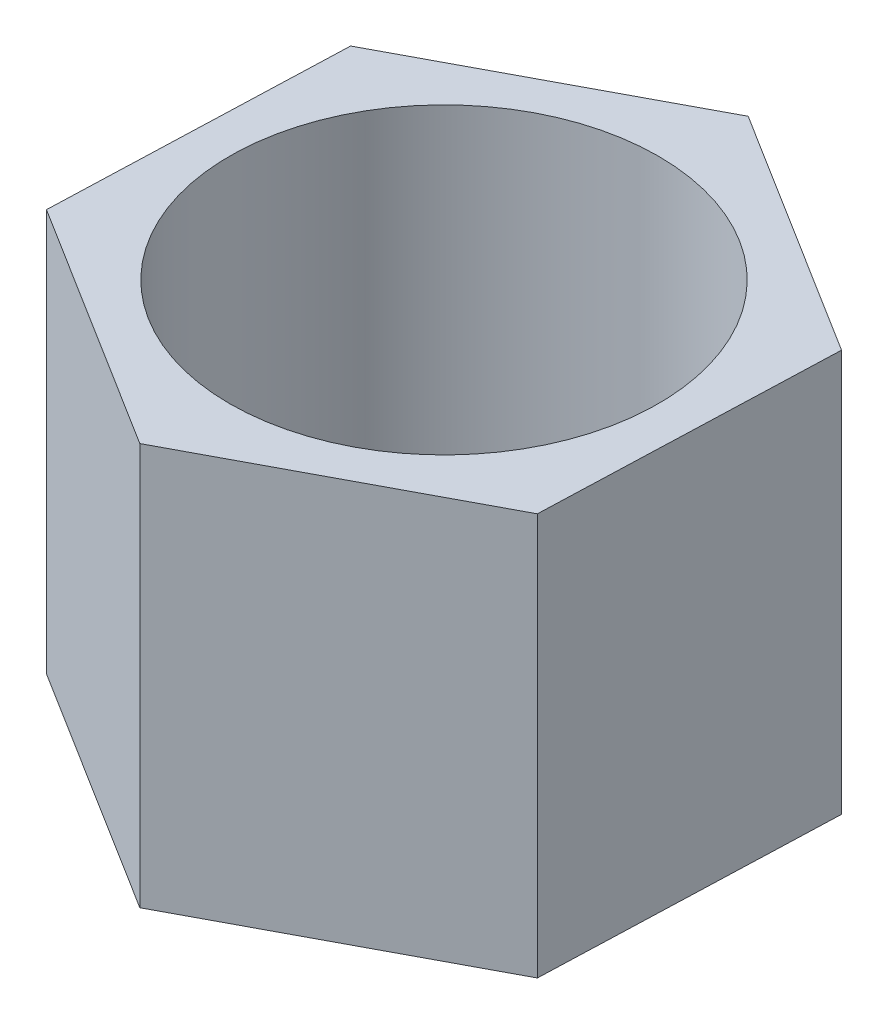
ISO-10303-21;
HEADER;
FILE_DESCRIPTION(('STEP AP214'),'2;1');
FILE_NAME('part.step','',(''),(''),'','','');
FILE_SCHEMA(('AUTOMOTIVE_DESIGN { 1 0 10303 214 1 1 1 1 }'));
ENDSEC;
DATA;
#1=APPLICATION_CONTEXT('core data for automotive mechanical design processes');
#2=APPLICATION_PROTOCOL_DEFINITION('international standard','automotive_design',2000,#1);
#3=PRODUCT_CONTEXT('',#1,'mechanical');
#4=PRODUCT('Part','Part','',(#3));
#5=PRODUCT_RELATED_PRODUCT_CATEGORY('part','',(#4));
#6=PRODUCT_DEFINITION_FORMATION('','',#4);
#7=PRODUCT_DEFINITION_CONTEXT('part definition',#1,'design');
#8=PRODUCT_DEFINITION('design','',#6,#7);
#9=PRODUCT_DEFINITION_SHAPE('','',#8);
#10=(LENGTH_UNIT() NAMED_UNIT(*) SI_UNIT(.MILLI.,.METRE.));
#11=(NAMED_UNIT(*) PLANE_ANGLE_UNIT() SI_UNIT($,.RADIAN.));
#12=(NAMED_UNIT(*) SI_UNIT($,.STERADIAN.) SOLID_ANGLE_UNIT());
#13=UNCERTAINTY_MEASURE_WITH_UNIT(LENGTH_MEASURE(1.E-05),#10,'distance_accuracy_value','');
#14=(GEOMETRIC_REPRESENTATION_CONTEXT(3) GLOBAL_UNCERTAINTY_ASSIGNED_CONTEXT((#13)) GLOBAL_UNIT_ASSIGNED_CONTEXT((#10,
#11,#12)) REPRESENTATION_CONTEXT('',''));
#15=CARTESIAN_POINT('',(0.,0.,0.));
#16=DIRECTION('',(0.,0.,1.));
#17=DIRECTION('',(1.,0.,0.));
#18=AXIS2_PLACEMENT_3D('',#15,#16,#17);
#19=CARTESIAN_POINT('',(0.,15.,0.));
#20=DIRECTION('',(0.,1.,0.));
#21=DIRECTION('',(0.,0.,1.));
#22=AXIS2_PLACEMENT_3D('',#19,#20,#21);
#23=PLANE('',#22);
#24=DIRECTION('',(-0.883119740596847,0.,0.469147656679811));
#25=VECTOR('',#24,1.);
#26=CARTESIAN_POINT('',(0.386856751164281,15.,-10.9628315314709));
#27=LINE('',#26,#25);
#28=CARTESIAN_POINT('',(0.386856751164281,15.,-10.9628315314709));
#29=VERTEX_POINT('',#28);
#30=CARTESIAN_POINT('',(-9.3006622280807,15.,-5.81644353986922));
#31=VERTEX_POINT('',#30);
#32=EDGE_CURVE('E131',#29,#31,#27,.T.);
#33=ORIENTED_EDGE('',*,*,#32,.T.);
#34=DIRECTION('',(-0.0352660814877668,0.,0.999377958280299));
#35=VECTOR('',#34,1.);
#36=CARTESIAN_POINT('',(-9.3006622280807,15.,-5.81644353986922));
#37=LINE('',#36,#35);
#38=CARTESIAN_POINT('',(-9.68751897924498,15.,5.14638799160165));
#39=VERTEX_POINT('',#38);
#40=EDGE_CURVE('E89',#31,#39,#37,.T.);
#41=ORIENTED_EDGE('',*,*,#40,.T.);
#42=DIRECTION('',(0.84785365910908,0.,0.530230301600487));
#43=VECTOR('',#42,1.);
#44=CARTESIAN_POINT('',(-9.68751897924498,15.,5.14638799160165));
#45=LINE('',#44,#43);
#46=CARTESIAN_POINT('',(-0.386856751164283,15.,10.9628315314709));
#47=VERTEX_POINT('',#46);
#48=EDGE_CURVE('E102',#39,#47,#45,.T.);
#49=ORIENTED_EDGE('',*,*,#48,.T.);
#50=DIRECTION('',(0.883119740596847,0.,-0.469147656679811));
#51=VECTOR('',#50,1.);
#52=CARTESIAN_POINT('',(-0.386856751164283,15.,10.9628315314709));
#53=LINE('',#52,#51);
#54=CARTESIAN_POINT('',(9.30066222808069,15.,5.81644353986922));
#55=VERTEX_POINT('',#54);
#56=EDGE_CURVE('E96',#47,#55,#53,.T.);
#57=ORIENTED_EDGE('',*,*,#56,.T.);
#58=DIRECTION('',(0.0352660814877666,0.,-0.999377958280299));
#59=VECTOR('',#58,1.);
#60=CARTESIAN_POINT('',(9.30066222808069,15.,5.81644353986922));
#61=LINE('',#60,#59);
#62=CARTESIAN_POINT('',(9.68751897924498,15.,-5.14638799160165));
#63=VERTEX_POINT('',#62);
#64=EDGE_CURVE('E100',#55,#63,#61,.T.);
#65=ORIENTED_EDGE('',*,*,#64,.T.);
#66=DIRECTION('',(-0.84785365910908,0.,-0.530230301600487));
#67=VECTOR('',#66,1.);
#68=CARTESIAN_POINT('',(9.68751897924498,15.,-5.14638799160165));
#69=LINE('',#68,#67);
#70=EDGE_CURVE('E52',#63,#29,#69,.T.);
#71=ORIENTED_EDGE('',*,*,#70,.T.);
#72=EDGE_LOOP('',(#33,#41,#49,#57,#65,#71));
#73=FACE_BOUND('',#72,.T.);
#74=CARTESIAN_POINT('',(0.,15.,0.));
#75=DIRECTION('',(0.,1.,0.));
#76=DIRECTION('',(0.,0.,1.));
#77=AXIS2_PLACEMENT_3D('',#74,#75,#76);
#78=CIRCLE('',#77,8.);
#79=CARTESIAN_POINT('',(0.,15.,8.));
#80=VERTEX_POINT('',#79);
#81=EDGE_CURVE('E124',#80,#80,#78,.T.);
#82=ORIENTED_EDGE('',*,*,#81,.F.);
#83=EDGE_LOOP('',(#82));
#84=FACE_BOUND('',#83,.T.);
#85=ADVANCED_FACE('F35',(#73,#84),#23,.T.);
#86=CARTESIAN_POINT('',(0.,0.,0.));
#87=DIRECTION('',(0.,1.,0.));
#88=DIRECTION('',(0.,0.,1.));
#89=AXIS2_PLACEMENT_3D('',#86,#87,#88);
#90=PLANE('',#89);
#91=DIRECTION('',(-0.883119740596847,0.,0.469147656679811));
#92=VECTOR('',#91,1.);
#93=CARTESIAN_POINT('',(0.386856751164281,0.,-10.9628315314709));
#94=LINE('',#93,#92);
#95=CARTESIAN_POINT('',(0.386856751164281,0.,-10.9628315314709));
#96=VERTEX_POINT('',#95);
#97=CARTESIAN_POINT('',(-9.3006622280807,0.,-5.81644353986922));
#98=VERTEX_POINT('',#97);
#99=EDGE_CURVE('E120',#96,#98,#94,.T.);
#100=ORIENTED_EDGE('',*,*,#99,.F.);
#101=DIRECTION('',(-0.84785365910908,0.,-0.530230301600487));
#102=VECTOR('',#101,1.);
#103=CARTESIAN_POINT('',(9.68751897924498,0.,-5.14638799160165));
#104=LINE('',#103,#102);
#105=CARTESIAN_POINT('',(9.68751897924498,0.,-5.14638799160165));
#106=VERTEX_POINT('',#105);
#107=EDGE_CURVE('E81',#106,#96,#104,.T.);
#108=ORIENTED_EDGE('',*,*,#107,.F.);
#109=DIRECTION('',(0.0352660814877666,0.,-0.999377958280299));
#110=VECTOR('',#109,1.);
#111=CARTESIAN_POINT('',(9.30066222808069,0.,5.81644353986922));
#112=LINE('',#111,#110);
#113=CARTESIAN_POINT('',(9.30066222808069,0.,5.81644353986922));
#114=VERTEX_POINT('',#113);
#115=EDGE_CURVE('E75',#114,#106,#112,.T.);
#116=ORIENTED_EDGE('',*,*,#115,.F.);
#117=DIRECTION('',(0.883119740596847,0.,-0.469147656679811));
#118=VECTOR('',#117,1.);
#119=CARTESIAN_POINT('',(-0.386856751164283,0.,10.9628315314709));
#120=LINE('',#119,#118);
#121=CARTESIAN_POINT('',(-0.386856751164283,0.,10.9628315314709));
#122=VERTEX_POINT('',#121);
#123=EDGE_CURVE('E110',#122,#114,#120,.T.);
#124=ORIENTED_EDGE('',*,*,#123,.F.);
#125=DIRECTION('',(0.84785365910908,0.,0.530230301600487));
#126=VECTOR('',#125,1.);
#127=CARTESIAN_POINT('',(-9.68751897924498,0.,5.14638799160165));
#128=LINE('',#127,#126);
#129=CARTESIAN_POINT('',(-9.68751897924498,0.,5.14638799160165));
#130=VERTEX_POINT('',#129);
#131=EDGE_CURVE('E126',#130,#122,#128,.T.);
#132=ORIENTED_EDGE('',*,*,#131,.F.);
#133=DIRECTION('',(-0.0352660814877668,0.,0.999377958280299));
#134=VECTOR('',#133,1.);
#135=CARTESIAN_POINT('',(-9.3006622280807,0.,-5.81644353986922));
#136=LINE('',#135,#134);
#137=EDGE_CURVE('E123',#98,#130,#136,.T.);
#138=ORIENTED_EDGE('',*,*,#137,.F.);
#139=EDGE_LOOP('',(#100,#108,#116,#124,#132,#138));
#140=FACE_BOUND('',#139,.T.);
#141=CARTESIAN_POINT('',(0.,0.,0.));
#142=DIRECTION('',(0.,1.,0.));
#143=DIRECTION('',(0.,0.,1.));
#144=AXIS2_PLACEMENT_3D('',#141,#142,#143);
#145=CIRCLE('',#144,8.);
#146=CARTESIAN_POINT('',(0.,0.,8.));
#147=VERTEX_POINT('',#146);
#148=EDGE_CURVE('E224',#147,#147,#145,.T.);
#149=ORIENTED_EDGE('',*,*,#148,.T.);
#150=EDGE_LOOP('',(#149));
#151=FACE_BOUND('',#150,.T.);
#152=ADVANCED_FACE('F140',(#140,#151),#90,.F.);
#153=CARTESIAN_POINT('',(0.386856751164281,15.,-10.9628315314709));
#154=DIRECTION('',(0.469147656679811,0.,0.883119740596847));
#155=DIRECTION('',(0.883119740596847,0.,-0.469147656679811));
#156=AXIS2_PLACEMENT_3D('',#153,#154,#155);
#157=PLANE('',#156);
#158=ORIENTED_EDGE('',*,*,#99,.T.);
#159=DIRECTION('',(0.,-1.,0.));
#160=VECTOR('',#159,1.);
#161=CARTESIAN_POINT('',(-9.3006622280807,15.,-5.81644353986922));
#162=LINE('',#161,#160);
#163=EDGE_CURVE('E11',#31,#98,#162,.T.);
#164=ORIENTED_EDGE('',*,*,#163,.F.);
#165=ORIENTED_EDGE('',*,*,#32,.F.);
#166=DIRECTION('',(0.,-1.,0.));
#167=VECTOR('',#166,1.);
#168=CARTESIAN_POINT('',(0.386856751164281,15.,-10.9628315314709));
#169=LINE('',#168,#167);
#170=EDGE_CURVE('E116',#29,#96,#169,.T.);
#171=ORIENTED_EDGE('',*,*,#170,.T.);
#172=EDGE_LOOP('',(#158,#164,#165,#171));
#173=FACE_BOUND('',#172,.T.);
#174=ADVANCED_FACE('F37',(#173),#157,.F.);
#175=CARTESIAN_POINT('',(-9.3006622280807,15.,-5.81644353986922));
#176=DIRECTION('',(0.999377958280299,0.,0.0352660814877668));
#177=DIRECTION('',(0.0352660814877668,0.,-0.999377958280299));
#178=AXIS2_PLACEMENT_3D('',#175,#176,#177);
#179=PLANE('',#178);
#180=ORIENTED_EDGE('',*,*,#137,.T.);
#181=DIRECTION('',(0.,-1.,0.));
#182=VECTOR('',#181,1.);
#183=CARTESIAN_POINT('',(-9.68751897924498,15.,5.14638799160165));
#184=LINE('',#183,#182);
#185=EDGE_CURVE('E44',#39,#130,#184,.T.);
#186=ORIENTED_EDGE('',*,*,#185,.F.);
#187=ORIENTED_EDGE('',*,*,#40,.F.);
#188=ORIENTED_EDGE('',*,*,#163,.T.);
#189=EDGE_LOOP('',(#180,#186,#187,#188));
#190=FACE_BOUND('',#189,.T.);
#191=ADVANCED_FACE('F165',(#190),#179,.F.);
#192=CARTESIAN_POINT('',(-9.68751897924498,15.,5.14638799160165));
#193=DIRECTION('',(0.530230301600487,0.,-0.84785365910908));
#194=DIRECTION('',(-0.84785365910908,0.,-0.530230301600487));
#195=AXIS2_PLACEMENT_3D('',#192,#193,#194);
#196=PLANE('',#195);
#197=ORIENTED_EDGE('',*,*,#131,.T.);
#198=DIRECTION('',(0.,-1.,0.));
#199=VECTOR('',#198,1.);
#200=CARTESIAN_POINT('',(-0.386856751164283,15.,10.9628315314709));
#201=LINE('',#200,#199);
#202=EDGE_CURVE('E111',#47,#122,#201,.T.);
#203=ORIENTED_EDGE('',*,*,#202,.F.);
#204=ORIENTED_EDGE('',*,*,#48,.F.);
#205=ORIENTED_EDGE('',*,*,#185,.T.);
#206=EDGE_LOOP('',(#197,#203,#204,#205));
#207=FACE_BOUND('',#206,.T.);
#208=ADVANCED_FACE('F137',(#207),#196,.F.);
#209=CARTESIAN_POINT('',(-0.386856751164283,15.,10.9628315314709));
#210=DIRECTION('',(-0.469147656679811,0.,-0.883119740596847));
#211=DIRECTION('',(-0.883119740596847,0.,0.469147656679811));
#212=AXIS2_PLACEMENT_3D('',#209,#210,#211);
#213=PLANE('',#212);
#214=ORIENTED_EDGE('',*,*,#123,.T.);
#215=DIRECTION('',(0.,-1.,0.));
#216=VECTOR('',#215,1.);
#217=CARTESIAN_POINT('',(9.30066222808069,15.,5.81644353986922));
#218=LINE('',#217,#216);
#219=EDGE_CURVE('E107',#55,#114,#218,.T.);
#220=ORIENTED_EDGE('',*,*,#219,.F.);
#221=ORIENTED_EDGE('',*,*,#56,.F.);
#222=ORIENTED_EDGE('',*,*,#202,.T.);
#223=EDGE_LOOP('',(#214,#220,#221,#222));
#224=FACE_BOUND('',#223,.T.);
#225=ADVANCED_FACE('F108',(#224),#213,.F.);
#226=CARTESIAN_POINT('',(9.30066222808069,15.,5.81644353986922));
#227=DIRECTION('',(-0.999377958280299,0.,-0.0352660814877666));
#228=DIRECTION('',(-0.0352660814877666,0.,0.999377958280299));
#229=AXIS2_PLACEMENT_3D('',#226,#227,#228);
#230=PLANE('',#229);
#231=ORIENTED_EDGE('',*,*,#115,.T.);
#232=DIRECTION('',(0.,-1.,0.));
#233=VECTOR('',#232,1.);
#234=CARTESIAN_POINT('',(9.68751897924498,15.,-5.14638799160165));
#235=LINE('',#234,#233);
#236=EDGE_CURVE('E112',#63,#106,#235,.T.);
#237=ORIENTED_EDGE('',*,*,#236,.F.);
#238=ORIENTED_EDGE('',*,*,#64,.F.);
#239=ORIENTED_EDGE('',*,*,#219,.T.);
#240=EDGE_LOOP('',(#231,#237,#238,#239));
#241=FACE_BOUND('',#240,.T.);
#242=ADVANCED_FACE('F114',(#241),#230,.F.);
#243=CARTESIAN_POINT('',(9.68751897924498,15.,-5.14638799160165));
#244=DIRECTION('',(-0.530230301600487,0.,0.84785365910908));
#245=DIRECTION('',(0.84785365910908,0.,0.530230301600487));
#246=AXIS2_PLACEMENT_3D('',#243,#244,#245);
#247=PLANE('',#246);
#248=ORIENTED_EDGE('',*,*,#107,.T.);
#249=ORIENTED_EDGE('',*,*,#170,.F.);
#250=ORIENTED_EDGE('',*,*,#70,.F.);
#251=ORIENTED_EDGE('',*,*,#236,.T.);
#252=EDGE_LOOP('',(#248,#249,#250,#251));
#253=FACE_BOUND('',#252,.T.);
#254=ADVANCED_FACE('F145',(#253),#247,.F.);
#255=CARTESIAN_POINT('',(0.,15.,0.));
#256=DIRECTION('',(0.,-1.,0.));
#257=DIRECTION('',(0.,0.,-1.));
#258=AXIS2_PLACEMENT_3D('',#255,#256,#257);
#259=CYLINDRICAL_SURFACE('',#258,8.);
#260=ORIENTED_EDGE('',*,*,#81,.T.);
#261=EDGE_LOOP('',(#260));
#262=FACE_BOUND('',#261,.T.);
#263=ORIENTED_EDGE('',*,*,#148,.F.);
#264=EDGE_LOOP('',(#263));
#265=FACE_BOUND('',#264,.T.);
#266=ADVANCED_FACE('F147',(#262,#265),#259,.F.);
#267=CLOSED_SHELL('',(#85,#152,#174,#191,#208,#225,#242,#254,#266));
#268=MANIFOLD_SOLID_BREP('B2',#267);
#269=ADVANCED_BREP_SHAPE_REPRESENTATION('',(#18,#268),#14);
#270=SHAPE_DEFINITION_REPRESENTATION(#9,#269);
ENDSEC;
END-ISO-10303-21;
